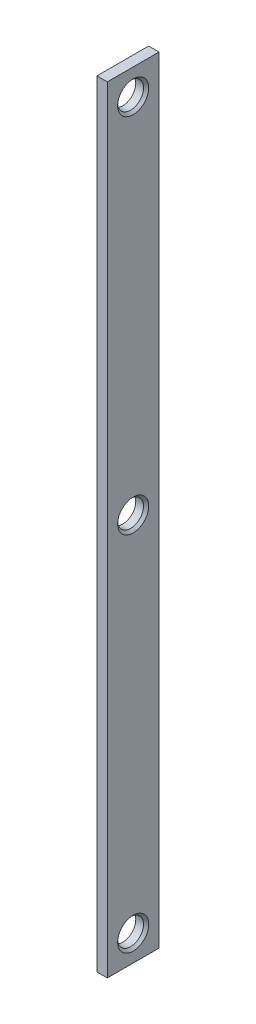
ISO-10303-21;
HEADER;
FILE_DESCRIPTION(('STEP AP214'),'2;1');
FILE_NAME('part.step','',(''),(''),'','','');
FILE_SCHEMA(('AUTOMOTIVE_DESIGN { 1 0 10303 214 1 1 1 1 }'));
ENDSEC;
DATA;
#1=APPLICATION_CONTEXT('core data for automotive mechanical design processes');
#2=APPLICATION_PROTOCOL_DEFINITION('international standard','automotive_design',2000,#1);
#3=PRODUCT_CONTEXT('',#1,'mechanical');
#4=PRODUCT('Part','Part','',(#3));
#5=PRODUCT_RELATED_PRODUCT_CATEGORY('part','',(#4));
#6=PRODUCT_DEFINITION_FORMATION('','',#4);
#7=PRODUCT_DEFINITION_CONTEXT('part definition',#1,'design');
#8=PRODUCT_DEFINITION('design','',#6,#7);
#9=PRODUCT_DEFINITION_SHAPE('','',#8);
#10=(LENGTH_UNIT() NAMED_UNIT(*) SI_UNIT(.MILLI.,.METRE.));
#11=(NAMED_UNIT(*) PLANE_ANGLE_UNIT() SI_UNIT($,.RADIAN.));
#12=(NAMED_UNIT(*) SI_UNIT($,.STERADIAN.) SOLID_ANGLE_UNIT());
#13=UNCERTAINTY_MEASURE_WITH_UNIT(LENGTH_MEASURE(1.E-05),#10,'distance_accuracy_value','');
#14=(GEOMETRIC_REPRESENTATION_CONTEXT(3) GLOBAL_UNCERTAINTY_ASSIGNED_CONTEXT((#13)) GLOBAL_UNIT_ASSIGNED_CONTEXT((#10,
#11,#12)) REPRESENTATION_CONTEXT('',''));
#15=CARTESIAN_POINT('',(0.,0.,0.));
#16=DIRECTION('',(0.,0.,1.));
#17=DIRECTION('',(1.,0.,0.));
#18=AXIS2_PLACEMENT_3D('',#15,#16,#17);
#19=CARTESIAN_POINT('',(2.,300.,-10.));
#20=DIRECTION('',(-1.,0.,0.));
#21=DIRECTION('',(0.,0.,1.));
#22=AXIS2_PLACEMENT_3D('',#19,#20,#21);
#23=PLANE('',#22);
#24=CARTESIAN_POINT('',(2.,10.0000000000001,-1.08911831736628E-11));
#25=DIRECTION('',(-1.,0.,0.));
#26=DIRECTION('',(0.,0.,1.));
#27=AXIS2_PLACEMENT_3D('',#24,#25,#26);
#28=CIRCLE('',#27,6.00000000000008);
#29=CARTESIAN_POINT('',(2.,10.0000000000001,5.99999999998919));
#30=VERTEX_POINT('',#29);
#31=EDGE_CURVE('E122',#30,#30,#28,.T.);
#32=ORIENTED_EDGE('',*,*,#31,.T.);
#33=EDGE_LOOP('',(#32));
#34=FACE_BOUND('',#33,.T.);
#35=CARTESIAN_POINT('',(2.,150.,-5.44572169109207E-12));
#36=DIRECTION('',(-1.,0.,0.));
#37=DIRECTION('',(0.,0.,1.));
#38=AXIS2_PLACEMENT_3D('',#35,#36,#37);
#39=CIRCLE('',#38,5.99999999999995);
#40=CARTESIAN_POINT('',(2.,150.,5.99999999999451));
#41=VERTEX_POINT('',#40);
#42=EDGE_CURVE('E119',#41,#41,#39,.T.);
#43=ORIENTED_EDGE('',*,*,#42,.T.);
#44=EDGE_LOOP('',(#43));
#45=FACE_BOUND('',#44,.T.);
#46=CARTESIAN_POINT('',(2.,290.,0.));
#47=DIRECTION('',(-1.,0.,0.));
#48=DIRECTION('',(0.,0.,1.));
#49=AXIS2_PLACEMENT_3D('',#46,#47,#48);
#50=CIRCLE('',#49,6.00000000000004);
#51=CARTESIAN_POINT('',(2.,290.,6.00000000000004));
#52=VERTEX_POINT('',#51);
#53=EDGE_CURVE('E116',#52,#52,#50,.T.);
#54=ORIENTED_EDGE('',*,*,#53,.T.);
#55=EDGE_LOOP('',(#54));
#56=FACE_BOUND('',#55,.T.);
#57=DIRECTION('',(0.,0.,-1.));
#58=VECTOR('',#57,1.);
#59=CARTESIAN_POINT('',(2.,0.,-10.));
#60=LINE('',#59,#58);
#61=CARTESIAN_POINT('',(2.,0.,10.));
#62=VERTEX_POINT('',#61);
#63=CARTESIAN_POINT('',(2.,0.,-10.));
#64=VERTEX_POINT('',#63);
#65=EDGE_CURVE('E103',#62,#64,#60,.T.);
#66=ORIENTED_EDGE('',*,*,#65,.T.);
#67=DIRECTION('',(0.,-1.,0.));
#68=VECTOR('',#67,1.);
#69=CARTESIAN_POINT('',(2.,300.,-10.));
#70=LINE('',#69,#68);
#71=CARTESIAN_POINT('',(2.,300.,-10.));
#72=VERTEX_POINT('',#71);
#73=EDGE_CURVE('E94',#72,#64,#70,.T.);
#74=ORIENTED_EDGE('',*,*,#73,.F.);
#75=DIRECTION('',(0.,0.,-1.));
#76=VECTOR('',#75,1.);
#77=CARTESIAN_POINT('',(2.,300.,-10.));
#78=LINE('',#77,#76);
#79=CARTESIAN_POINT('',(2.,300.,10.));
#80=VERTEX_POINT('',#79);
#81=EDGE_CURVE('E88',#80,#72,#78,.T.);
#82=ORIENTED_EDGE('',*,*,#81,.F.);
#83=DIRECTION('',(0.,-1.,0.));
#84=VECTOR('',#83,1.);
#85=CARTESIAN_POINT('',(2.,300.,10.));
#86=LINE('',#85,#84);
#87=EDGE_CURVE('E99',#80,#62,#86,.T.);
#88=ORIENTED_EDGE('',*,*,#87,.T.);
#89=EDGE_LOOP('',(#66,#74,#82,#88));
#90=FACE_BOUND('',#89,.T.);
#91=ADVANCED_FACE('F35',(#34,#45,#56,#90),#23,.F.);
#92=CARTESIAN_POINT('',(-2.,300.,-10.));
#93=DIRECTION('',(0.,0.,1.));
#94=DIRECTION('',(1.,0.,0.));
#95=AXIS2_PLACEMENT_3D('',#92,#93,#94);
#96=PLANE('',#95);
#97=DIRECTION('',(-1.,0.,0.));
#98=VECTOR('',#97,1.);
#99=CARTESIAN_POINT('',(-2.,0.,-10.));
#100=LINE('',#99,#98);
#101=CARTESIAN_POINT('',(-2.,0.,-10.));
#102=VERTEX_POINT('',#101);
#103=EDGE_CURVE('E93',#64,#102,#100,.T.);
#104=ORIENTED_EDGE('',*,*,#103,.T.);
#105=DIRECTION('',(0.,-1.,0.));
#106=VECTOR('',#105,1.);
#107=CARTESIAN_POINT('',(-2.,300.,-10.));
#108=LINE('',#107,#106);
#109=CARTESIAN_POINT('',(-2.,300.,-10.));
#110=VERTEX_POINT('',#109);
#111=EDGE_CURVE('E91',#110,#102,#108,.T.);
#112=ORIENTED_EDGE('',*,*,#111,.F.);
#113=DIRECTION('',(-1.,0.,0.));
#114=VECTOR('',#113,1.);
#115=CARTESIAN_POINT('',(-2.,300.,-10.));
#116=LINE('',#115,#114);
#117=EDGE_CURVE('E83',#72,#110,#116,.T.);
#118=ORIENTED_EDGE('',*,*,#117,.F.);
#119=ORIENTED_EDGE('',*,*,#73,.T.);
#120=EDGE_LOOP('',(#104,#112,#118,#119));
#121=FACE_BOUND('',#120,.T.);
#122=ADVANCED_FACE('F92',(#121),#96,.F.);
#123=CARTESIAN_POINT('',(-2.,300.,-10.));
#124=DIRECTION('',(1.,0.,0.));
#125=DIRECTION('',(0.,0.,-1.));
#126=AXIS2_PLACEMENT_3D('',#123,#124,#125);
#127=PLANE('',#126);
#128=CARTESIAN_POINT('',(-2.,290.,0.));
#129=DIRECTION('',(1.,0.,0.));
#130=DIRECTION('',(0.,0.,-1.));
#131=AXIS2_PLACEMENT_3D('',#128,#129,#130);
#132=CIRCLE('',#131,5.00000000000001);
#133=CARTESIAN_POINT('',(-2.,290.,-5.00000000000001));
#134=VERTEX_POINT('',#133);
#135=EDGE_CURVE('E106',#134,#134,#132,.T.);
#136=ORIENTED_EDGE('',*,*,#135,.T.);
#137=EDGE_LOOP('',(#136));
#138=FACE_BOUND('',#137,.T.);
#139=CARTESIAN_POINT('',(-2.,150.,-5.44520127404928E-12));
#140=DIRECTION('',(1.,0.,0.));
#141=DIRECTION('',(0.,0.,-1.));
#142=AXIS2_PLACEMENT_3D('',#139,#140,#141);
#143=CIRCLE('',#142,5.00000000000001);
#144=CARTESIAN_POINT('',(-2.,150.,-5.00000000000545));
#145=VERTEX_POINT('',#144);
#146=EDGE_CURVE('E178',#145,#145,#143,.T.);
#147=ORIENTED_EDGE('',*,*,#146,.T.);
#148=EDGE_LOOP('',(#147));
#149=FACE_BOUND('',#148,.T.);
#150=CARTESIAN_POINT('',(-2.,10.0000000000001,-1.089066275662E-11));
#151=DIRECTION('',(1.,0.,0.));
#152=DIRECTION('',(0.,0.,-1.));
#153=AXIS2_PLACEMENT_3D('',#150,#151,#152);
#154=CIRCLE('',#153,5.00000000000001);
#155=CARTESIAN_POINT('',(-2.,10.0000000000001,-5.0000000000109));
#156=VERTEX_POINT('',#155);
#157=EDGE_CURVE('E181',#156,#156,#154,.T.);
#158=ORIENTED_EDGE('',*,*,#157,.T.);
#159=EDGE_LOOP('',(#158));
#160=FACE_BOUND('',#159,.T.);
#161=DIRECTION('',(0.,0.,1.));
#162=VECTOR('',#161,1.);
#163=CARTESIAN_POINT('',(-2.,0.,-10.));
#164=LINE('',#163,#162);
#165=CARTESIAN_POINT('',(-2.,0.,10.));
#166=VERTEX_POINT('',#165);
#167=EDGE_CURVE('E69',#102,#166,#164,.T.);
#168=ORIENTED_EDGE('',*,*,#167,.T.);
#169=DIRECTION('',(0.,-1.,0.));
#170=VECTOR('',#169,1.);
#171=CARTESIAN_POINT('',(-2.,300.,10.));
#172=LINE('',#171,#170);
#173=CARTESIAN_POINT('',(-2.,300.,10.));
#174=VERTEX_POINT('',#173);
#175=EDGE_CURVE('E95',#174,#166,#172,.T.);
#176=ORIENTED_EDGE('',*,*,#175,.F.);
#177=DIRECTION('',(0.,0.,1.));
#178=VECTOR('',#177,1.);
#179=CARTESIAN_POINT('',(-2.,300.,-10.));
#180=LINE('',#179,#178);
#181=EDGE_CURVE('E86',#110,#174,#180,.T.);
#182=ORIENTED_EDGE('',*,*,#181,.F.);
#183=ORIENTED_EDGE('',*,*,#111,.T.);
#184=EDGE_LOOP('',(#168,#176,#182,#183));
#185=FACE_BOUND('',#184,.T.);
#186=ADVANCED_FACE('F97',(#138,#149,#160,#185),#127,.F.);
#187=CARTESIAN_POINT('',(-2.,300.,10.));
#188=DIRECTION('',(0.,0.,-1.));
#189=DIRECTION('',(-1.,0.,0.));
#190=AXIS2_PLACEMENT_3D('',#187,#188,#189);
#191=PLANE('',#190);
#192=DIRECTION('',(1.,0.,0.));
#193=VECTOR('',#192,1.);
#194=CARTESIAN_POINT('',(-2.,0.,10.));
#195=LINE('',#194,#193);
#196=EDGE_CURVE('E75',#166,#62,#195,.T.);
#197=ORIENTED_EDGE('',*,*,#196,.T.);
#198=ORIENTED_EDGE('',*,*,#87,.F.);
#199=DIRECTION('',(1.,0.,0.));
#200=VECTOR('',#199,1.);
#201=CARTESIAN_POINT('',(-2.,300.,10.));
#202=LINE('',#201,#200);
#203=EDGE_CURVE('E52',#174,#80,#202,.T.);
#204=ORIENTED_EDGE('',*,*,#203,.F.);
#205=ORIENTED_EDGE('',*,*,#175,.T.);
#206=EDGE_LOOP('',(#197,#198,#204,#205));
#207=FACE_BOUND('',#206,.T.);
#208=ADVANCED_FACE('F154',(#207),#191,.F.);
#209=CARTESIAN_POINT('',(0.,300.,0.));
#210=DIRECTION('',(0.,1.,0.));
#211=DIRECTION('',(0.,0.,1.));
#212=AXIS2_PLACEMENT_3D('',#209,#210,#211);
#213=PLANE('',#212);
#214=ORIENTED_EDGE('',*,*,#81,.T.);
#215=ORIENTED_EDGE('',*,*,#117,.T.);
#216=ORIENTED_EDGE('',*,*,#181,.T.);
#217=ORIENTED_EDGE('',*,*,#203,.T.);
#218=EDGE_LOOP('',(#214,#215,#216,#217));
#219=FACE_BOUND('',#218,.T.);
#220=ADVANCED_FACE('F84',(#219),#213,.T.);
#221=CARTESIAN_POINT('',(0.,0.,0.));
#222=DIRECTION('',(0.,1.,0.));
#223=DIRECTION('',(0.,0.,1.));
#224=AXIS2_PLACEMENT_3D('',#221,#222,#223);
#225=PLANE('',#224);
#226=ORIENTED_EDGE('',*,*,#65,.F.);
#227=ORIENTED_EDGE('',*,*,#196,.F.);
#228=ORIENTED_EDGE('',*,*,#167,.F.);
#229=ORIENTED_EDGE('',*,*,#103,.F.);
#230=EDGE_LOOP('',(#226,#227,#228,#229));
#231=FACE_BOUND('',#230,.T.);
#232=ADVANCED_FACE('F158',(#231),#225,.F.);
#233=CARTESIAN_POINT('',(-2.,10.0000000000001,-1.089066275662E-11));
#234=DIRECTION('',(1.,0.,0.));
#235=DIRECTION('',(0.,0.,-1.));
#236=AXIS2_PLACEMENT_3D('',#233,#234,#235);
#237=CYLINDRICAL_SURFACE('',#236,5.00000000000001);
#238=CARTESIAN_POINT('',(0.999999999999954,10.0000000000001,-1.08910530694021E-11));
#239=DIRECTION('',(-1.,0.,0.));
#240=DIRECTION('',(0.,0.,1.));
#241=AXIS2_PLACEMENT_3D('',#238,#239,#240);
#242=CIRCLE('',#241,5.00000000000001);
#243=CARTESIAN_POINT('',(0.999999999999955,10.0000000000001,4.99999999998912));
#244=VERTEX_POINT('',#243);
#245=EDGE_CURVE('E113',#244,#244,#242,.F.);
#246=ORIENTED_EDGE('',*,*,#245,.T.);
#247=EDGE_LOOP('',(#246));
#248=FACE_BOUND('',#247,.T.);
#249=ORIENTED_EDGE('',*,*,#157,.F.);
#250=EDGE_LOOP('',(#249));
#251=FACE_BOUND('',#250,.T.);
#252=ADVANCED_FACE('F161',(#248,#251),#237,.F.);
#253=CARTESIAN_POINT('',(-2.,150.,-5.44520127404928E-12));
#254=DIRECTION('',(1.,0.,0.));
#255=DIRECTION('',(0.,0.,-1.));
#256=AXIS2_PLACEMENT_3D('',#253,#254,#255);
#257=CYLINDRICAL_SURFACE('',#256,5.00000000000001);
#258=CARTESIAN_POINT('',(1.00000000000007,150.,-5.44559158683138E-12));
#259=DIRECTION('',(-1.,0.,0.));
#260=DIRECTION('',(0.,0.,1.));
#261=AXIS2_PLACEMENT_3D('',#258,#259,#260);
#262=CIRCLE('',#261,5.00000000000001);
#263=CARTESIAN_POINT('',(1.00000000000007,150.,4.99999999999456));
#264=VERTEX_POINT('',#263);
#265=EDGE_CURVE('E44',#264,#264,#262,.F.);
#266=ORIENTED_EDGE('',*,*,#265,.T.);
#267=EDGE_LOOP('',(#266));
#268=FACE_BOUND('',#267,.T.);
#269=ORIENTED_EDGE('',*,*,#146,.F.);
#270=EDGE_LOOP('',(#269));
#271=FACE_BOUND('',#270,.T.);
#272=ADVANCED_FACE('F127',(#268,#271),#257,.F.);
#273=CARTESIAN_POINT('',(-2.,290.,0.));
#274=DIRECTION('',(1.,0.,0.));
#275=DIRECTION('',(0.,0.,-1.));
#276=AXIS2_PLACEMENT_3D('',#273,#274,#275);
#277=CYLINDRICAL_SURFACE('',#276,5.00000000000001);
#278=CARTESIAN_POINT('',(0.999999999999984,290.,0.));
#279=DIRECTION('',(-1.,0.,0.));
#280=DIRECTION('',(0.,0.,1.));
#281=AXIS2_PLACEMENT_3D('',#278,#279,#280);
#282=CIRCLE('',#281,5.00000000000001);
#283=CARTESIAN_POINT('',(0.999999999999985,290.,5.00000000000001));
#284=VERTEX_POINT('',#283);
#285=EDGE_CURVE('E11',#284,#284,#282,.F.);
#286=ORIENTED_EDGE('',*,*,#285,.T.);
#287=EDGE_LOOP('',(#286));
#288=FACE_BOUND('',#287,.T.);
#289=ORIENTED_EDGE('',*,*,#135,.F.);
#290=EDGE_LOOP('',(#289));
#291=FACE_BOUND('',#290,.T.);
#292=ADVANCED_FACE('F139',(#288,#291),#277,.F.);
#293=CARTESIAN_POINT('',(0.999999999999955,10.0000000000001,-1.08910530694021E-11));
#294=DIRECTION('',(1.,0.,0.));
#295=DIRECTION('',(0.,0.,-1.));
#296=AXIS2_PLACEMENT_3D('',#293,#294,#295);
#297=CONICAL_SURFACE('',#296,5.00000000000001,0.785398163397462);
#298=ORIENTED_EDGE('',*,*,#31,.F.);
#299=EDGE_LOOP('',(#298));
#300=FACE_BOUND('',#299,.T.);
#301=ORIENTED_EDGE('',*,*,#245,.F.);
#302=EDGE_LOOP('',(#301));
#303=FACE_BOUND('',#302,.T.);
#304=ADVANCED_FACE('F132',(#300,#303),#297,.F.);
#305=CARTESIAN_POINT('',(1.00000000000007,150.,-5.44559158683138E-12));
#306=DIRECTION('',(1.,0.,0.));
#307=DIRECTION('',(0.,0.,-1.));
#308=AXIS2_PLACEMENT_3D('',#305,#306,#307);
#309=CONICAL_SURFACE('',#308,5.00000000000001,0.785398163397456);
#310=ORIENTED_EDGE('',*,*,#42,.F.);
#311=EDGE_LOOP('',(#310));
#312=FACE_BOUND('',#311,.T.);
#313=ORIENTED_EDGE('',*,*,#265,.F.);
#314=EDGE_LOOP('',(#313));
#315=FACE_BOUND('',#314,.T.);
#316=ADVANCED_FACE('F130',(#312,#315),#309,.F.);
#317=CARTESIAN_POINT('',(0.999999999999984,290.,0.));
#318=DIRECTION('',(1.,0.,0.));
#319=DIRECTION('',(0.,0.,-1.));
#320=AXIS2_PLACEMENT_3D('',#317,#318,#319);
#321=CONICAL_SURFACE('',#320,5.00000000000001,0.785398163397455);
#322=ORIENTED_EDGE('',*,*,#53,.F.);
#323=EDGE_LOOP('',(#322));
#324=FACE_BOUND('',#323,.T.);
#325=ORIENTED_EDGE('',*,*,#285,.F.);
#326=EDGE_LOOP('',(#325));
#327=FACE_BOUND('',#326,.T.);
#328=ADVANCED_FACE('F37',(#324,#327),#321,.F.);
#329=CLOSED_SHELL('',(#91,#122,#186,#208,#220,#232,#252,#272,#292,#304,#316,#328));
#330=MANIFOLD_SOLID_BREP('B2',#329);
#331=ADVANCED_BREP_SHAPE_REPRESENTATION('',(#18,#330),#14);
#332=SHAPE_DEFINITION_REPRESENTATION(#9,#331);
ENDSEC;
END-ISO-10303-21;
